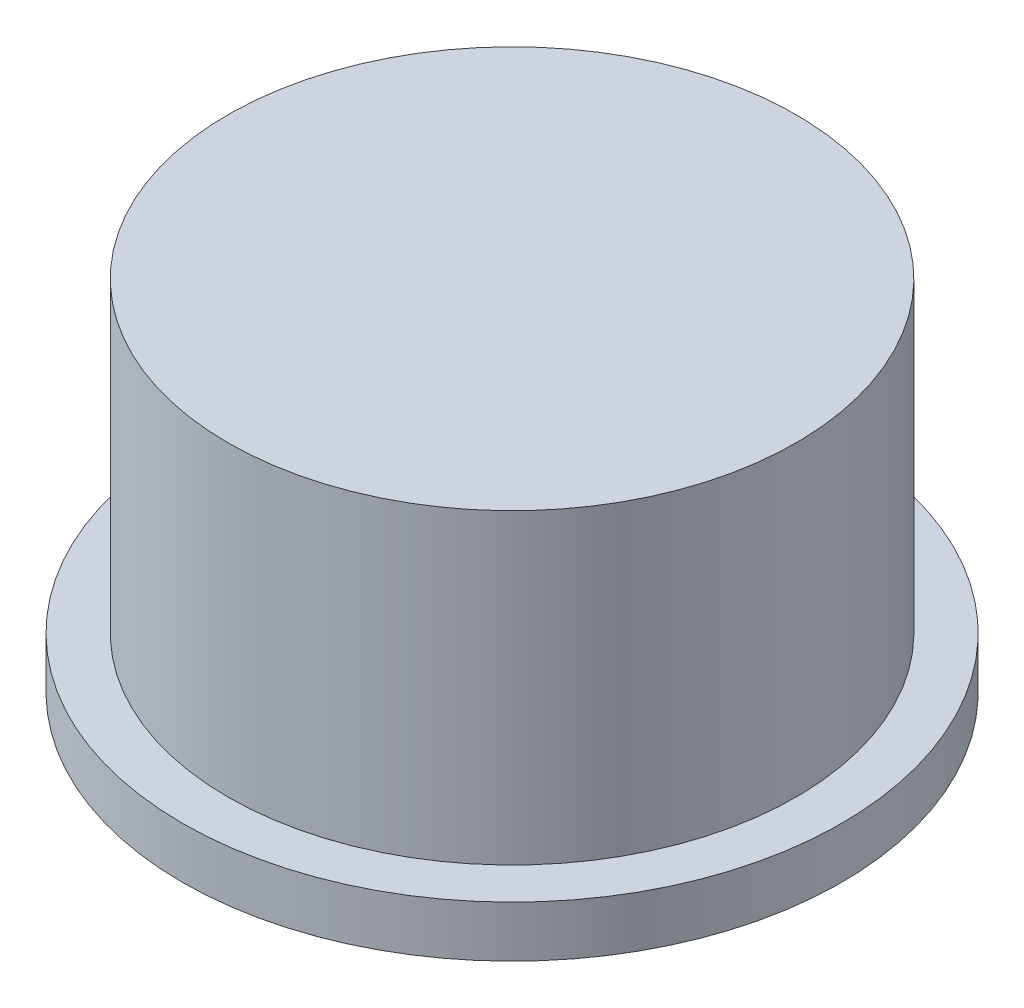
ISO-10303-21;
HEADER;
FILE_DESCRIPTION(('STEP AP214'),'2;1');
FILE_NAME('part.step','',(''),(''),'','','');
FILE_SCHEMA(('AUTOMOTIVE_DESIGN { 1 0 10303 214 1 1 1 1 }'));
ENDSEC;
DATA;
#1=APPLICATION_CONTEXT('core data for automotive mechanical design processes');
#2=APPLICATION_PROTOCOL_DEFINITION('international standard','automotive_design',2000,#1);
#3=PRODUCT_CONTEXT('',#1,'mechanical');
#4=PRODUCT('Part','Part','',(#3));
#5=PRODUCT_RELATED_PRODUCT_CATEGORY('part','',(#4));
#6=PRODUCT_DEFINITION_FORMATION('','',#4);
#7=PRODUCT_DEFINITION_CONTEXT('part definition',#1,'design');
#8=PRODUCT_DEFINITION('design','',#6,#7);
#9=PRODUCT_DEFINITION_SHAPE('','',#8);
#10=(LENGTH_UNIT() NAMED_UNIT(*) SI_UNIT(.MILLI.,.METRE.));
#11=(NAMED_UNIT(*) PLANE_ANGLE_UNIT() SI_UNIT($,.RADIAN.));
#12=(NAMED_UNIT(*) SI_UNIT($,.STERADIAN.) SOLID_ANGLE_UNIT());
#13=UNCERTAINTY_MEASURE_WITH_UNIT(LENGTH_MEASURE(1.E-05),#10,'distance_accuracy_value','');
#14=(GEOMETRIC_REPRESENTATION_CONTEXT(3) GLOBAL_UNCERTAINTY_ASSIGNED_CONTEXT((#13)) GLOBAL_UNIT_ASSIGNED_CONTEXT((#10,
#11,#12)) REPRESENTATION_CONTEXT('',''));
#15=CARTESIAN_POINT('',(0.,0.,0.));
#16=DIRECTION('',(0.,0.,1.));
#17=DIRECTION('',(1.,0.,0.));
#18=AXIS2_PLACEMENT_3D('',#15,#16,#17);
#19=CARTESIAN_POINT('',(0.,8.001,0.));
#20=DIRECTION('',(0.,-1.,0.));
#21=DIRECTION('',(0.,0.,-1.));
#22=AXIS2_PLACEMENT_3D('',#19,#20,#21);
#23=CYLINDRICAL_SURFACE('',#22,6.35);
#24=CARTESIAN_POINT('',(0.,1.143,0.));
#25=DIRECTION('',(0.,1.,0.));
#26=DIRECTION('',(0.,0.,1.));
#27=AXIS2_PLACEMENT_3D('',#24,#25,#26);
#28=CIRCLE('',#27,6.35);
#29=CARTESIAN_POINT('',(0.,1.143,6.35));
#30=VERTEX_POINT('',#29);
#31=EDGE_CURVE('E55',#30,#30,#28,.T.);
#32=ORIENTED_EDGE('',*,*,#31,.T.);
#33=EDGE_LOOP('',(#32));
#34=FACE_BOUND('',#33,.T.);
#35=CARTESIAN_POINT('',(0.,8.001,0.));
#36=DIRECTION('',(0.,1.,0.));
#37=DIRECTION('',(0.,0.,1.));
#38=AXIS2_PLACEMENT_3D('',#35,#36,#37);
#39=CIRCLE('',#38,6.35);
#40=CARTESIAN_POINT('',(0.,8.001,6.35));
#41=VERTEX_POINT('',#40);
#42=EDGE_CURVE('E43',#41,#41,#39,.T.);
#43=ORIENTED_EDGE('',*,*,#42,.F.);
#44=EDGE_LOOP('',(#43));
#45=FACE_BOUND('',#44,.T.);
#46=ADVANCED_FACE('F37',(#34,#45),#23,.T.);
#47=CARTESIAN_POINT('',(0.,8.001,0.));
#48=DIRECTION('',(0.,1.,0.));
#49=DIRECTION('',(0.,0.,1.));
#50=AXIS2_PLACEMENT_3D('',#47,#48,#49);
#51=PLANE('',#50);
#52=ORIENTED_EDGE('',*,*,#42,.T.);
#53=EDGE_LOOP('',(#52));
#54=FACE_BOUND('',#53,.T.);
#55=ADVANCED_FACE('F65',(#54),#51,.T.);
#56=CARTESIAN_POINT('',(0.,1.143,0.));
#57=DIRECTION('',(0.,1.,0.));
#58=DIRECTION('',(0.,0.,1.));
#59=AXIS2_PLACEMENT_3D('',#56,#57,#58);
#60=PLANE('',#59);
#61=CARTESIAN_POINT('',(0.,1.143,0.));
#62=DIRECTION('',(0.,1.,0.));
#63=DIRECTION('',(0.,0.,1.));
#64=AXIS2_PLACEMENT_3D('',#61,#62,#63);
#65=CIRCLE('',#64,7.366);
#66=CARTESIAN_POINT('',(0.,1.143,7.366));
#67=VERTEX_POINT('',#66);
#68=EDGE_CURVE('E47',#67,#67,#65,.T.);
#69=ORIENTED_EDGE('',*,*,#68,.T.);
#70=EDGE_LOOP('',(#69));
#71=FACE_BOUND('',#70,.T.);
#72=ORIENTED_EDGE('',*,*,#31,.F.);
#73=EDGE_LOOP('',(#72));
#74=FACE_BOUND('',#73,.T.);
#75=ADVANCED_FACE('F62',(#71,#74),#60,.T.);
#76=CARTESIAN_POINT('',(0.,1.143,0.));
#77=DIRECTION('',(0.,-1.,0.));
#78=DIRECTION('',(0.,0.,-1.));
#79=AXIS2_PLACEMENT_3D('',#76,#77,#78);
#80=CYLINDRICAL_SURFACE('',#79,7.366);
#81=ORIENTED_EDGE('',*,*,#68,.F.);
#82=EDGE_LOOP('',(#81));
#83=FACE_BOUND('',#82,.T.);
#84=CARTESIAN_POINT('',(0.,0.,0.));
#85=DIRECTION('',(0.,1.,0.));
#86=DIRECTION('',(0.,0.,1.));
#87=AXIS2_PLACEMENT_3D('',#84,#85,#86);
#88=CIRCLE('',#87,7.366);
#89=CARTESIAN_POINT('',(0.,0.,7.366));
#90=VERTEX_POINT('',#89);
#91=EDGE_CURVE('E51',#90,#90,#88,.T.);
#92=ORIENTED_EDGE('',*,*,#91,.T.);
#93=EDGE_LOOP('',(#92));
#94=FACE_BOUND('',#93,.T.);
#95=ADVANCED_FACE('F64',(#83,#94),#80,.T.);
#96=CARTESIAN_POINT('',(0.,0.,0.));
#97=DIRECTION('',(0.,1.,0.));
#98=DIRECTION('',(0.,0.,1.));
#99=AXIS2_PLACEMENT_3D('',#96,#97,#98);
#100=PLANE('',#99);
#101=CARTESIAN_POINT('',(0.,0.,0.));
#102=DIRECTION('',(0.,1.,0.));
#103=DIRECTION('',(0.,0.,1.));
#104=AXIS2_PLACEMENT_3D('',#101,#102,#103);
#105=CIRCLE('',#104,3.59629438913631);
#106=CARTESIAN_POINT('',(0.,0.,3.59629438913631));
#107=VERTEX_POINT('',#106);
#108=EDGE_CURVE('E10',#107,#107,#105,.F.);
#109=ORIENTED_EDGE('',*,*,#108,.F.);
#110=EDGE_LOOP('',(#109));
#111=FACE_BOUND('',#110,.T.);
#112=ORIENTED_EDGE('',*,*,#91,.F.);
#113=EDGE_LOOP('',(#112));
#114=FACE_BOUND('',#113,.T.);
#115=ADVANCED_FACE('F72',(#111,#114),#100,.F.);
#116=CARTESIAN_POINT('',(0.,2.23333333333333,0.));
#117=DIRECTION('',(0.,1.,0.));
#118=DIRECTION('',(-1.,0.,0.));
#119=AXIS2_PLACEMENT_3D('',#116,#117,#118);
#120=SPHERICAL_SURFACE('',#119,4.23333333333333);
#121=ORIENTED_EDGE('',*,*,#108,.T.);
#122=EDGE_LOOP('',(#121));
#123=FACE_BOUND('',#122,.T.);
#124=ADVANCED_FACE('F100',(#123),#120,.T.);
#125=CLOSED_SHELL('',(#46,#55,#75,#95,#115,#124));
#126=MANIFOLD_SOLID_BREP('B2',#125);
#127=ADVANCED_BREP_SHAPE_REPRESENTATION('',(#18,#126),#14);
#128=SHAPE_DEFINITION_REPRESENTATION(#9,#127);
ENDSEC;
END-ISO-10303-21;
